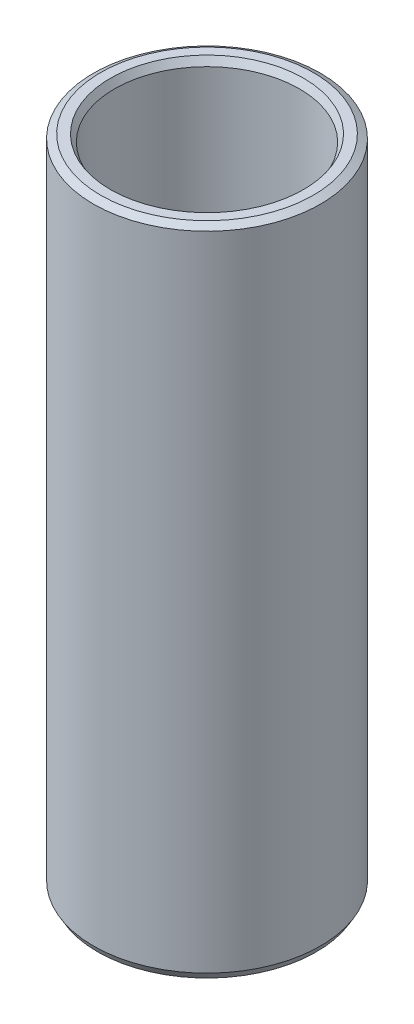
ISO-10303-21;
HEADER;
FILE_DESCRIPTION(('STEP AP214'),'2;1');
FILE_NAME('part.step','',(''),(''),'','','');
FILE_SCHEMA(('AUTOMOTIVE_DESIGN { 1 0 10303 214 1 1 1 1 }'));
ENDSEC;
DATA;
#1=APPLICATION_CONTEXT('core data for automotive mechanical design processes');
#2=APPLICATION_PROTOCOL_DEFINITION('international standard','automotive_design',2000,#1);
#3=PRODUCT_CONTEXT('',#1,'mechanical');
#4=PRODUCT('Part','Part','',(#3));
#5=PRODUCT_RELATED_PRODUCT_CATEGORY('part','',(#4));
#6=PRODUCT_DEFINITION_FORMATION('','',#4);
#7=PRODUCT_DEFINITION_CONTEXT('part definition',#1,'design');
#8=PRODUCT_DEFINITION('design','',#6,#7);
#9=PRODUCT_DEFINITION_SHAPE('','',#8);
#10=(LENGTH_UNIT() NAMED_UNIT(*) SI_UNIT(.MILLI.,.METRE.));
#11=(NAMED_UNIT(*) PLANE_ANGLE_UNIT() SI_UNIT($,.RADIAN.));
#12=(NAMED_UNIT(*) SI_UNIT($,.STERADIAN.) SOLID_ANGLE_UNIT());
#13=UNCERTAINTY_MEASURE_WITH_UNIT(LENGTH_MEASURE(1.E-05),#10,'distance_accuracy_value','');
#14=(GEOMETRIC_REPRESENTATION_CONTEXT(3) GLOBAL_UNCERTAINTY_ASSIGNED_CONTEXT((#13)) GLOBAL_UNIT_ASSIGNED_CONTEXT((#10,
#11,#12)) REPRESENTATION_CONTEXT('',''));
#15=CARTESIAN_POINT('',(0.,0.,0.));
#16=DIRECTION('',(0.,0.,1.));
#17=DIRECTION('',(1.,0.,0.));
#18=AXIS2_PLACEMENT_3D('',#15,#16,#17);
#19=CARTESIAN_POINT('',(0.,187.219808890446,0.));
#20=DIRECTION('',(0.,-1.,0.));
#21=DIRECTION('',(0.,0.,-1.));
#22=AXIS2_PLACEMENT_3D('',#19,#20,#21);
#23=CYLINDRICAL_SURFACE('',#22,32.5);
#24=CARTESIAN_POINT('',(0.,2.04506144933697,0.));
#25=DIRECTION('',(0.,1.,0.));
#26=DIRECTION('',(0.,0.,1.));
#27=AXIS2_PLACEMENT_3D('',#24,#25,#26);
#28=CIRCLE('',#27,32.5);
#29=CARTESIAN_POINT('',(0.,2.04506144933697,32.5));
#30=VERTEX_POINT('',#29);
#31=EDGE_CURVE('E10',#30,#30,#28,.T.);
#32=ORIENTED_EDGE('',*,*,#31,.T.);
#33=EDGE_LOOP('',(#32));
#34=FACE_BOUND('',#33,.T.);
#35=CARTESIAN_POINT('',(0.,186.039092112162,0.));
#36=DIRECTION('',(0.,1.,0.));
#37=DIRECTION('',(0.,0.,1.));
#38=AXIS2_PLACEMENT_3D('',#35,#36,#37);
#39=CIRCLE('',#38,32.5);
#40=CARTESIAN_POINT('',(0.,186.039092112162,32.5));
#41=VERTEX_POINT('',#40);
#42=EDGE_CURVE('E50',#41,#41,#39,.F.);
#43=ORIENTED_EDGE('',*,*,#42,.T.);
#44=EDGE_LOOP('',(#43));
#45=FACE_BOUND('',#44,.T.);
#46=ADVANCED_FACE('F39',(#34,#45),#23,.T.);
#47=CARTESIAN_POINT('',(0.,187.219808890446,0.));
#48=DIRECTION('',(0.,1.,0.));
#49=DIRECTION('',(0.,0.,1.));
#50=AXIS2_PLACEMENT_3D('',#47,#48,#49);
#51=PLANE('',#50);
#52=CARTESIAN_POINT('',(0.,187.219808890446,0.));
#53=DIRECTION('',(0.,1.,0.));
#54=DIRECTION('',(0.,0.,1.));
#55=AXIS2_PLACEMENT_3D('',#52,#53,#54);
#56=CIRCLE('',#55,27.64942829597);
#57=CARTESIAN_POINT('',(0.,187.219808890446,27.64942829597));
#58=VERTEX_POINT('',#57);
#59=EDGE_CURVE('E58',#58,#58,#56,.F.);
#60=ORIENTED_EDGE('',*,*,#59,.T.);
#61=EDGE_LOOP('',(#60));
#62=FACE_BOUND('',#61,.T.);
#63=CARTESIAN_POINT('',(0.,187.219808890446,0.));
#64=DIRECTION('',(0.,1.,0.));
#65=DIRECTION('',(0.,0.,1.));
#66=AXIS2_PLACEMENT_3D('',#63,#64,#65);
#67=CIRCLE('',#66,30.454938550663);
#68=CARTESIAN_POINT('',(0.,187.219808890446,30.454938550663));
#69=VERTEX_POINT('',#68);
#70=EDGE_CURVE('E61',#69,#69,#67,.T.);
#71=ORIENTED_EDGE('',*,*,#70,.T.);
#72=EDGE_LOOP('',(#71));
#73=FACE_BOUND('',#72,.T.);
#74=ADVANCED_FACE('F88',(#62,#73),#51,.T.);
#75=CARTESIAN_POINT('',(0.,0.,0.));
#76=DIRECTION('',(0.,1.,0.));
#77=DIRECTION('',(0.,0.,1.));
#78=AXIS2_PLACEMENT_3D('',#75,#76,#77);
#79=PLANE('',#78);
#80=CARTESIAN_POINT('',(0.,0.,0.));
#81=DIRECTION('',(0.,1.,0.));
#82=DIRECTION('',(0.,0.,1.));
#83=AXIS2_PLACEMENT_3D('',#80,#81,#82);
#84=CIRCLE('',#83,28.513772967023);
#85=CARTESIAN_POINT('',(0.,0.,-28.513772967023));
#86=VERTEX_POINT('',#85);
#87=EDGE_CURVE('E51',#86,#86,#84,.T.);
#88=ORIENTED_EDGE('',*,*,#87,.T.);
#89=EDGE_LOOP('',(#88));
#90=FACE_BOUND('',#89,.T.);
#91=CARTESIAN_POINT('',(0.,0.,0.));
#92=DIRECTION('',(0.,1.,0.));
#93=DIRECTION('',(0.,0.,1.));
#94=AXIS2_PLACEMENT_3D('',#91,#92,#93);
#95=CIRCLE('',#94,31.319283221716);
#96=CARTESIAN_POINT('',(0.,0.,31.319283221716));
#97=VERTEX_POINT('',#96);
#98=EDGE_CURVE('E54',#97,#97,#95,.F.);
#99=ORIENTED_EDGE('',*,*,#98,.T.);
#100=EDGE_LOOP('',(#99));
#101=FACE_BOUND('',#100,.T.);
#102=ADVANCED_FACE('F83',(#90,#101),#79,.F.);
#103=CARTESIAN_POINT('',(0.,187.219808890446,0.));
#104=DIRECTION('',(0.,-1.,0.));
#105=DIRECTION('',(0.,0.,-1.));
#106=AXIS2_PLACEMENT_3D('',#103,#104,#105);
#107=CYLINDRICAL_SURFACE('',#106,26.4687115176859);
#108=CARTESIAN_POINT('',(0.,185.174747441109,0.));
#109=DIRECTION('',(0.,1.,0.));
#110=DIRECTION('',(0.,0.,1.));
#111=AXIS2_PLACEMENT_3D('',#108,#109,#110);
#112=CIRCLE('',#111,26.4687115176859);
#113=CARTESIAN_POINT('',(0.,185.174747441109,26.4687115176859));
#114=VERTEX_POINT('',#113);
#115=EDGE_CURVE('E67',#114,#114,#112,.T.);
#116=ORIENTED_EDGE('',*,*,#115,.T.);
#117=EDGE_LOOP('',(#116));
#118=FACE_BOUND('',#117,.T.);
#119=CARTESIAN_POINT('',(0.,1.18071677828407,0.));
#120=DIRECTION('',(0.,1.,0.));
#121=DIRECTION('',(0.,0.,1.));
#122=AXIS2_PLACEMENT_3D('',#119,#120,#121);
#123=CIRCLE('',#122,26.4687115176859);
#124=CARTESIAN_POINT('',(0.,1.18071677828407,-26.4687115176859));
#125=VERTEX_POINT('',#124);
#126=EDGE_CURVE('E69',#125,#125,#123,.F.);
#127=ORIENTED_EDGE('',*,*,#126,.T.);
#128=EDGE_LOOP('',(#127));
#129=FACE_BOUND('',#128,.T.);
#130=ADVANCED_FACE('F71',(#118,#129),#107,.F.);
#131=CARTESIAN_POINT('',(0.,185.174747441109,0.));
#132=DIRECTION('',(0.,1.,0.));
#133=DIRECTION('',(0.,0.,1.));
#134=AXIS2_PLACEMENT_3D('',#131,#132,#133);
#135=CONICAL_SURFACE('',#134,26.4687115176859,0.523598775598298);
#136=ORIENTED_EDGE('',*,*,#59,.F.);
#137=EDGE_LOOP('',(#136));
#138=FACE_BOUND('',#137,.T.);
#139=ORIENTED_EDGE('',*,*,#115,.F.);
#140=EDGE_LOOP('',(#139));
#141=FACE_BOUND('',#140,.T.);
#142=ADVANCED_FACE('F77',(#138,#141),#135,.F.);
#143=CARTESIAN_POINT('',(0.,0.,0.));
#144=DIRECTION('',(0.,-1.,0.));
#145=DIRECTION('',(0.,0.,-1.));
#146=AXIS2_PLACEMENT_3D('',#143,#144,#145);
#147=CONICAL_SURFACE('',#146,28.513772967023,1.04719755119659);
#148=CARTESIAN_POINT('',(0.,1.18071677828407,-26.4687115176859));
#149=CARTESIAN_POINT('',(0.,1.16841764517695,-26.4900142411165));
#150=CARTESIAN_POINT('',(0.,1.15611851206982,-26.5113169645471));
#151=CARTESIAN_POINT('',(0.,1.13152024585557,-26.5539224114083));
#152=CARTESIAN_POINT('',(0.,1.11922111274845,-26.5752251348389));
#153=CARTESIAN_POINT('',(0.,1.09462284653419,-26.6178305817001));
#154=CARTESIAN_POINT('',(0.,1.08232371342707,-26.6391333051307));
#155=CARTESIAN_POINT('',(0.,1.05772544721282,-26.6817387519919));
#156=CARTESIAN_POINT('',(0.,1.04542631410569,-26.7030414754225));
#157=CARTESIAN_POINT('',(0.,1.02082804789144,-26.7456469222837));
#158=CARTESIAN_POINT('',(0.,1.00852891478431,-26.7669496457143));
#159=CARTESIAN_POINT('',(0.,0.983930648570061,-26.8095550925754));
#160=CARTESIAN_POINT('',(0.,0.971631515462936,-26.830857816006));
#161=CARTESIAN_POINT('',(0.,0.947033249248685,-26.8734632628672));
#162=CARTESIAN_POINT('',(0.,0.934734116141559,-26.8947659862978));
#163=CARTESIAN_POINT('',(0.,0.910135849927307,-26.937371433159));
#164=CARTESIAN_POINT('',(0.,0.897836716820182,-26.9586741565896));
#165=CARTESIAN_POINT('',(0.,0.87323845060593,-27.0012796034508));
#166=CARTESIAN_POINT('',(0.,0.860939317498804,-27.0225823268814));
#167=CARTESIAN_POINT('',(0.,0.836341051284553,-27.0651877737426));
#168=CARTESIAN_POINT('',(0.,0.824041918177427,-27.0864904971732));
#169=CARTESIAN_POINT('',(0.,0.799443651963175,-27.1290959440344));
#170=CARTESIAN_POINT('',(0.,0.78714451885605,-27.1503986674649));
#171=CARTESIAN_POINT('',(0.,0.762546252641798,-27.1930041143261));
#172=CARTESIAN_POINT('',(0.,0.750247119534672,-27.2143068377567));
#173=CARTESIAN_POINT('',(0.,0.72564885332042,-27.2569122846179));
#174=CARTESIAN_POINT('',(0.,0.713349720213295,-27.2782150080485));
#175=CARTESIAN_POINT('',(0.,0.688751453999043,-27.3208204549097));
#176=CARTESIAN_POINT('',(0.,0.676452320891918,-27.3421231783403));
#177=CARTESIAN_POINT('',(0.,0.651854054677666,-27.3847286252015));
#178=CARTESIAN_POINT('',(0.,0.63955492157054,-27.4060313486321));
#179=CARTESIAN_POINT('',(0.,0.614956655356289,-27.4486367954933));
#180=CARTESIAN_POINT('',(0.,0.602657522249163,-27.4699395189239));
#181=CARTESIAN_POINT('',(0.,0.578059256034911,-27.512544965785));
#182=CARTESIAN_POINT('',(0.,0.565760122927786,-27.5338476892156));
#183=CARTESIAN_POINT('',(0.,0.541161856713534,-27.5764531360768));
#184=CARTESIAN_POINT('',(0.,0.528862723606408,-27.5977558595074));
#185=CARTESIAN_POINT('',(0.,0.504264457392157,-27.6403613063686));
#186=CARTESIAN_POINT('',(0.,0.491965324285031,-27.6616640297992));
#187=CARTESIAN_POINT('',(0.,0.467367058070779,-27.7042694766604));
#188=CARTESIAN_POINT('',(0.,0.455067924963654,-27.725572200091));
#189=CARTESIAN_POINT('',(0.,0.430469658749402,-27.7681776469522));
#190=CARTESIAN_POINT('',(0.,0.418170525642276,-27.7894803703828));
#191=CARTESIAN_POINT('',(0.,0.393572259428024,-27.832085817244));
#192=CARTESIAN_POINT('',(0.,0.381273126320899,-27.8533885406745));
#193=CARTESIAN_POINT('',(0.,0.356674860106648,-27.8959939875357));
#194=CARTESIAN_POINT('',(0.,0.344375726999522,-27.9172967109663));
#195=CARTESIAN_POINT('',(0.,0.31977746078527,-27.9599021578275));
#196=CARTESIAN_POINT('',(0.,0.307478327678144,-27.9812048812581));
#197=CARTESIAN_POINT('',(0.,0.282880061463893,-28.0238103281193));
#198=CARTESIAN_POINT('',(0.,0.270580928356767,-28.0451130515499));
#199=CARTESIAN_POINT('',(0.,0.245982662142515,-28.0877184984111));
#200=CARTESIAN_POINT('',(0.,0.23368352903539,-28.1090212218417));
#201=CARTESIAN_POINT('',(0.,0.209085262821138,-28.1516266687029));
#202=CARTESIAN_POINT('',(0.,0.196786129714013,-28.1729293921335));
#203=CARTESIAN_POINT('',(0.,0.172187863499761,-28.2155348389946));
#204=CARTESIAN_POINT('',(0.,0.159888730392635,-28.2368375624252));
#205=CARTESIAN_POINT('',(0.,0.135290464178383,-28.2794430092864));
#206=CARTESIAN_POINT('',(0.,0.122991331071258,-28.300745732717));
#207=CARTESIAN_POINT('',(0.,0.0983930648570063,-28.3433511795782));
#208=CARTESIAN_POINT('',(0.,0.0860939317498804,-28.3646539030088));
#209=CARTESIAN_POINT('',(0.,0.0614956655356288,-28.40725934987));
#210=CARTESIAN_POINT('',(0.,0.0491965324285031,-28.4285620733006));
#211=CARTESIAN_POINT('',(0.,0.0245982662142516,-28.4711675201618));
#212=CARTESIAN_POINT('',(0.,0.0122991331071258,-28.4924702435924));
#213=CARTESIAN_POINT('',(0.,0.,-28.513772967023));
#214=B_SPLINE_CURVE_WITH_KNOTS('',3,(#148,#149,#150,#151,#152,#153,#154,#155,#156,#157,#158,
#159,#160,#161,#162,#163,#164,#165,#166,#167,#168,#169,#170,#171,#172,#173,#174,#175,#176,#177,
#178,#179,#180,#181,#182,#183,#184,#185,#186,#187,#188,#189,#190,#191,#192,#193,#194,#195,#196,
#197,#198,#199,#200,#201,#202,#203,#204,#205,#206,#207,#208,#209,#210,#211,#212,#213),
.UNSPECIFIED.,.F.,.F.,(4,2,2,2,2,2,2,2,2,2,2,2,2,2,2,2,2,2,2,2,2,2,2,2,2,2,2,2,2,2,2,2,4),(0.,
0.0737947986427539,0.147589597285508,0.221384395928262,0.295179194571016,0.368973993213767,
0.44276879185652,0.516563590499274,0.590358389142028,0.664153187784782,0.737947986427536,
0.81174278507029,0.885537583713041,0.959332382355795,1.03312718099855,1.1069219796413,
1.18071677828406,1.25451157692681,1.32830637556956,1.40210117421232,1.47589597285507,
1.54969077149782,1.62348557014058,1.69728036878333,1.77107516742609,1.84486996606884,
1.91866476471159,1.99245956335435,2.0662543619971,2.14004916063985,2.21384395928261,
2.28763875792536,2.36143355656811),.UNSPECIFIED.);
#215=EDGE_CURVE('BSEAM73',#125,#86,#214,.T.);
#216=ORIENTED_EDGE('',*,*,#126,.F.);
#217=ORIENTED_EDGE('',*,*,#87,.F.);
#218=ORIENTED_EDGE('',*,*,#215,.T.);
#219=ORIENTED_EDGE('',*,*,#215,.F.);
#220=EDGE_LOOP('',(#216,#218,#217,#219));
#221=FACE_BOUND('',#220,.T.);
#222=ADVANCED_FACE('F73',(#221),#147,.F.);
#223=CARTESIAN_POINT('',(0.,2.04506144933697,0.));
#224=DIRECTION('',(0.,1.,0.));
#225=DIRECTION('',(0.,0.,1.));
#226=AXIS2_PLACEMENT_3D('',#223,#224,#225);
#227=CONICAL_SURFACE('',#226,32.5,0.523598775598301);
#228=ORIENTED_EDGE('',*,*,#98,.F.);
#229=EDGE_LOOP('',(#228));
#230=FACE_BOUND('',#229,.T.);
#231=ORIENTED_EDGE('',*,*,#31,.F.);
#232=EDGE_LOOP('',(#231));
#233=FACE_BOUND('',#232,.T.);
#234=ADVANCED_FACE('F76',(#230,#233),#227,.T.);
#235=CARTESIAN_POINT('',(0.,187.219808890446,0.));
#236=DIRECTION('',(0.,-1.,0.));
#237=DIRECTION('',(0.,0.,-1.));
#238=AXIS2_PLACEMENT_3D('',#235,#236,#237);
#239=CONICAL_SURFACE('',#238,30.454938550663,1.0471975511966);
#240=ORIENTED_EDGE('',*,*,#42,.F.);
#241=EDGE_LOOP('',(#240));
#242=FACE_BOUND('',#241,.T.);
#243=ORIENTED_EDGE('',*,*,#70,.F.);
#244=EDGE_LOOP('',(#243));
#245=FACE_BOUND('',#244,.T.);
#246=ADVANCED_FACE('F45',(#242,#245),#239,.T.);
#247=CLOSED_SHELL('',(#46,#74,#102,#130,#142,#222,#234,#246));
#248=MANIFOLD_SOLID_BREP('B2',#247);
#249=ADVANCED_BREP_SHAPE_REPRESENTATION('',(#18,#248),#14);
#250=SHAPE_DEFINITION_REPRESENTATION(#9,#249);
ENDSEC;
END-ISO-10303-21;
